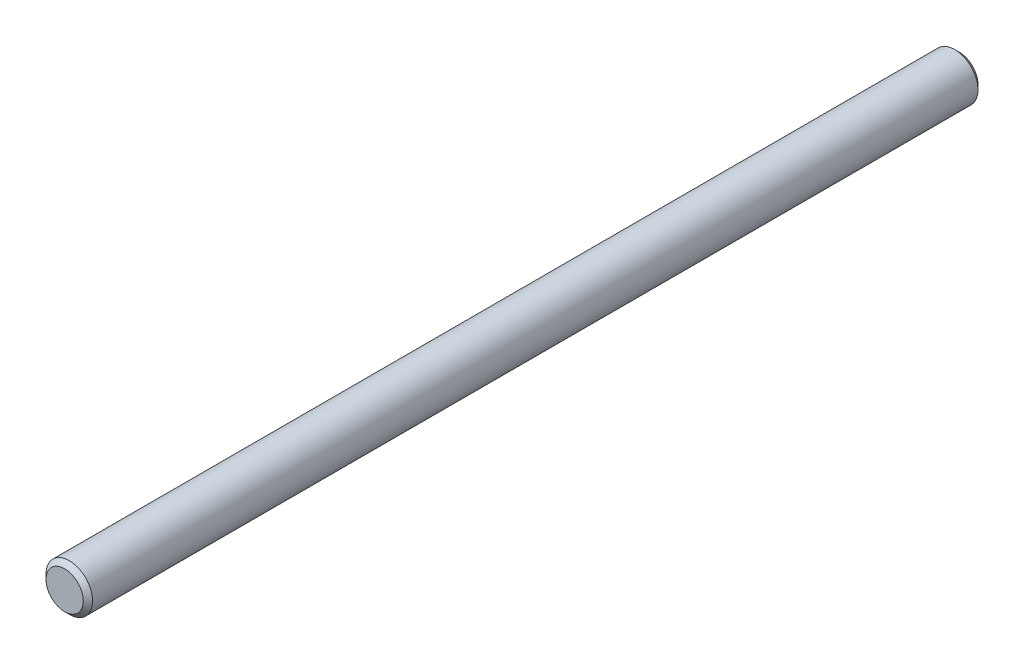
ISO-10303-21;
HEADER;
FILE_DESCRIPTION(('STEP AP214'),'2;1');
FILE_NAME('part.step','',(''),(''),'','','');
FILE_SCHEMA(('AUTOMOTIVE_DESIGN { 1 0 10303 214 1 1 1 1 }'));
ENDSEC;
DATA;
#1=APPLICATION_CONTEXT('core data for automotive mechanical design processes');
#2=APPLICATION_PROTOCOL_DEFINITION('international standard','automotive_design',2000,#1);
#3=PRODUCT_CONTEXT('',#1,'mechanical');
#4=PRODUCT('Part','Part','',(#3));
#5=PRODUCT_RELATED_PRODUCT_CATEGORY('part','',(#4));
#6=PRODUCT_DEFINITION_FORMATION('','',#4);
#7=PRODUCT_DEFINITION_CONTEXT('part definition',#1,'design');
#8=PRODUCT_DEFINITION('design','',#6,#7);
#9=PRODUCT_DEFINITION_SHAPE('','',#8);
#10=(LENGTH_UNIT() NAMED_UNIT(*) SI_UNIT(.MILLI.,.METRE.));
#11=(NAMED_UNIT(*) PLANE_ANGLE_UNIT() SI_UNIT($,.RADIAN.));
#12=(NAMED_UNIT(*) SI_UNIT($,.STERADIAN.) SOLID_ANGLE_UNIT());
#13=UNCERTAINTY_MEASURE_WITH_UNIT(LENGTH_MEASURE(1.E-05),#10,'distance_accuracy_value','');
#14=(GEOMETRIC_REPRESENTATION_CONTEXT(3) GLOBAL_UNCERTAINTY_ASSIGNED_CONTEXT((#13)) GLOBAL_UNIT_ASSIGNED_CONTEXT((#10,
#11,#12)) REPRESENTATION_CONTEXT('',''));
#15=CARTESIAN_POINT('',(0.,0.,0.));
#16=DIRECTION('',(0.,0.,1.));
#17=DIRECTION('',(1.,0.,0.));
#18=AXIS2_PLACEMENT_3D('',#15,#16,#17);
#19=CARTESIAN_POINT('',(0.,0.,152.4));
#20=DIRECTION('',(0.,0.,-1.));
#21=DIRECTION('',(-1.,0.,0.));
#22=AXIS2_PLACEMENT_3D('',#19,#20,#21);
#23=CYLINDRICAL_SURFACE('',#22,7.9375);
#24=CARTESIAN_POINT('',(0.,0.,-150.8125));
#25=DIRECTION('',(0.,0.,1.));
#26=DIRECTION('',(1.,0.,0.));
#27=AXIS2_PLACEMENT_3D('',#24,#25,#26);
#28=CIRCLE('',#27,7.9375);
#29=CARTESIAN_POINT('',(7.9375,0.,-150.8125));
#30=VERTEX_POINT('',#29);
#31=EDGE_CURVE('E45',#30,#30,#28,.T.);
#32=ORIENTED_EDGE('',*,*,#31,.T.);
#33=EDGE_LOOP('',(#32));
#34=FACE_BOUND('',#33,.T.);
#35=CARTESIAN_POINT('',(0.,0.,150.8125));
#36=DIRECTION('',(0.,0.,1.));
#37=DIRECTION('',(1.,0.,0.));
#38=AXIS2_PLACEMENT_3D('',#35,#36,#37);
#39=CIRCLE('',#38,7.9375);
#40=CARTESIAN_POINT('',(7.9375,0.,150.8125));
#41=VERTEX_POINT('',#40);
#42=EDGE_CURVE('E49',#41,#41,#39,.F.);
#43=ORIENTED_EDGE('',*,*,#42,.T.);
#44=EDGE_LOOP('',(#43));
#45=FACE_BOUND('',#44,.T.);
#46=ADVANCED_FACE('F34',(#34,#45),#23,.T.);
#47=CARTESIAN_POINT('',(0.,0.,152.4));
#48=DIRECTION('',(0.,0.,1.));
#49=DIRECTION('',(1.,0.,0.));
#50=AXIS2_PLACEMENT_3D('',#47,#48,#49);
#51=PLANE('',#50);
#52=CARTESIAN_POINT('',(0.,0.,152.4));
#53=DIRECTION('',(0.,0.,1.));
#54=DIRECTION('',(1.,0.,0.));
#55=AXIS2_PLACEMENT_3D('',#52,#53,#54);
#56=CIRCLE('',#55,6.35000000000013);
#57=CARTESIAN_POINT('',(6.35000000000013,0.,152.4));
#58=VERTEX_POINT('',#57);
#59=EDGE_CURVE('E10',#58,#58,#56,.T.);
#60=ORIENTED_EDGE('',*,*,#59,.T.);
#61=EDGE_LOOP('',(#60));
#62=FACE_BOUND('',#61,.T.);
#63=ADVANCED_FACE('F65',(#62),#51,.T.);
#64=CARTESIAN_POINT('',(0.,0.,-152.4));
#65=DIRECTION('',(0.,0.,1.));
#66=DIRECTION('',(1.,0.,0.));
#67=AXIS2_PLACEMENT_3D('',#64,#65,#66);
#68=PLANE('',#67);
#69=CARTESIAN_POINT('',(0.,0.,-152.4));
#70=DIRECTION('',(0.,0.,1.));
#71=DIRECTION('',(1.,0.,0.));
#72=AXIS2_PLACEMENT_3D('',#69,#70,#71);
#73=CIRCLE('',#72,6.34999999999963);
#74=CARTESIAN_POINT('',(6.34999999999963,0.,-152.4));
#75=VERTEX_POINT('',#74);
#76=EDGE_CURVE('E41',#75,#75,#73,.F.);
#77=ORIENTED_EDGE('',*,*,#76,.T.);
#78=EDGE_LOOP('',(#77));
#79=FACE_BOUND('',#78,.T.);
#80=ADVANCED_FACE('F62',(#79),#68,.F.);
#81=CARTESIAN_POINT('',(0.,0.,-150.8125));
#82=DIRECTION('',(0.,0.,1.));
#83=DIRECTION('',(1.,0.,0.));
#84=AXIS2_PLACEMENT_3D('',#81,#82,#83);
#85=CONICAL_SURFACE('',#84,7.9375,0.785398163397453);
#86=ORIENTED_EDGE('',*,*,#76,.F.);
#87=EDGE_LOOP('',(#86));
#88=FACE_BOUND('',#87,.T.);
#89=ORIENTED_EDGE('',*,*,#31,.F.);
#90=EDGE_LOOP('',(#89));
#91=FACE_BOUND('',#90,.T.);
#92=ADVANCED_FACE('F58',(#88,#91),#85,.T.);
#93=CARTESIAN_POINT('',(0.,0.,152.4));
#94=DIRECTION('',(0.,0.,-1.));
#95=DIRECTION('',(-1.,0.,0.));
#96=AXIS2_PLACEMENT_3D('',#93,#94,#95);
#97=CONICAL_SURFACE('',#96,6.35000000000013,0.785398163397445);
#98=ORIENTED_EDGE('',*,*,#42,.F.);
#99=EDGE_LOOP('',(#98));
#100=FACE_BOUND('',#99,.T.);
#101=ORIENTED_EDGE('',*,*,#59,.F.);
#102=EDGE_LOOP('',(#101));
#103=FACE_BOUND('',#102,.T.);
#104=ADVANCED_FACE('F36',(#100,#103),#97,.T.);
#105=CLOSED_SHELL('',(#46,#63,#80,#92,#104));
#106=MANIFOLD_SOLID_BREP('B2',#105);
#107=ADVANCED_BREP_SHAPE_REPRESENTATION('',(#18,#106),#14);
#108=SHAPE_DEFINITION_REPRESENTATION(#9,#107);
ENDSEC;
END-ISO-10303-21;
